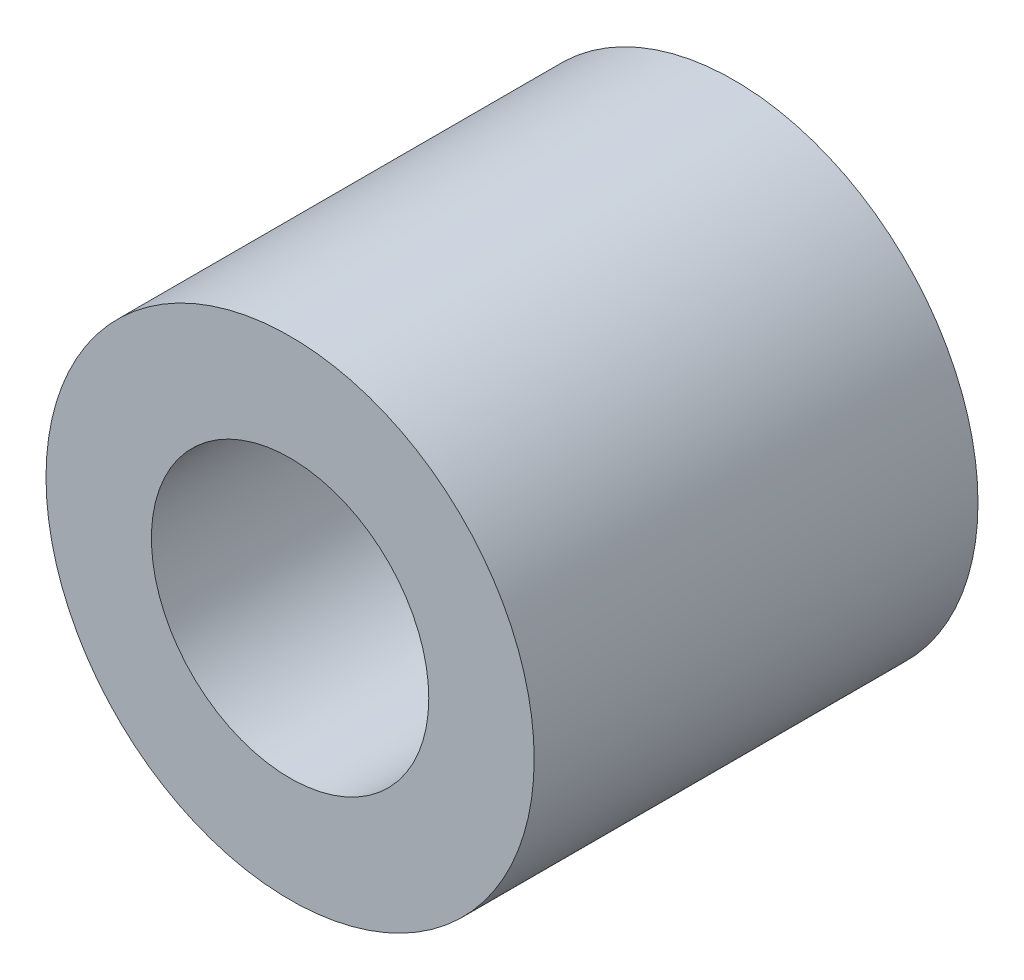
ISO-10303-21;
HEADER;
FILE_DESCRIPTION(('STEP AP214'),'2;1');
FILE_NAME('part.step','',(''),(''),'','','');
FILE_SCHEMA(('AUTOMOTIVE_DESIGN { 1 0 10303 214 1 1 1 1 }'));
ENDSEC;
DATA;
#1=APPLICATION_CONTEXT('core data for automotive mechanical design processes');
#2=APPLICATION_PROTOCOL_DEFINITION('international standard','automotive_design',2000,#1);
#3=PRODUCT_CONTEXT('',#1,'mechanical');
#4=PRODUCT('Part','Part','',(#3));
#5=PRODUCT_RELATED_PRODUCT_CATEGORY('part','',(#4));
#6=PRODUCT_DEFINITION_FORMATION('','',#4);
#7=PRODUCT_DEFINITION_CONTEXT('part definition',#1,'design');
#8=PRODUCT_DEFINITION('design','',#6,#7);
#9=PRODUCT_DEFINITION_SHAPE('','',#8);
#10=(LENGTH_UNIT() NAMED_UNIT(*) SI_UNIT(.MILLI.,.METRE.));
#11=(NAMED_UNIT(*) PLANE_ANGLE_UNIT() SI_UNIT($,.RADIAN.));
#12=(NAMED_UNIT(*) SI_UNIT($,.STERADIAN.) SOLID_ANGLE_UNIT());
#13=UNCERTAINTY_MEASURE_WITH_UNIT(LENGTH_MEASURE(1.E-05),#10,'distance_accuracy_value','');
#14=(GEOMETRIC_REPRESENTATION_CONTEXT(3) GLOBAL_UNCERTAINTY_ASSIGNED_CONTEXT((#13)) GLOBAL_UNIT_ASSIGNED_CONTEXT((#10,
#11,#12)) REPRESENTATION_CONTEXT('',''));
#15=CARTESIAN_POINT('',(0.,0.,0.));
#16=DIRECTION('',(0.,0.,1.));
#17=DIRECTION('',(1.,0.,0.));
#18=AXIS2_PLACEMENT_3D('',#15,#16,#17);
#19=CARTESIAN_POINT('',(0.,0.,4.));
#20=DIRECTION('',(0.,0.,1.));
#21=DIRECTION('',(1.,0.,0.));
#22=AXIS2_PLACEMENT_3D('',#19,#20,#21);
#23=PLANE('',#22);
#24=CARTESIAN_POINT('',(0.,0.,4.));
#25=DIRECTION('',(0.,0.,1.));
#26=DIRECTION('',(1.,0.,0.));
#27=AXIS2_PLACEMENT_3D('',#24,#25,#26);
#28=CIRCLE('',#27,2.2);
#29=CARTESIAN_POINT('',(2.2,0.,4.));
#30=VERTEX_POINT('',#29);
#31=EDGE_CURVE('E10',#30,#30,#28,.T.);
#32=ORIENTED_EDGE('',*,*,#31,.T.);
#33=EDGE_LOOP('',(#32));
#34=FACE_BOUND('',#33,.T.);
#35=CARTESIAN_POINT('',(0.,0.,4.));
#36=DIRECTION('',(0.,0.,1.));
#37=DIRECTION('',(1.,0.,0.));
#38=AXIS2_PLACEMENT_3D('',#35,#36,#37);
#39=CIRCLE('',#38,1.25);
#40=CARTESIAN_POINT('',(1.25,0.,4.));
#41=VERTEX_POINT('',#40);
#42=EDGE_CURVE('E46',#41,#41,#39,.T.);
#43=ORIENTED_EDGE('',*,*,#42,.F.);
#44=EDGE_LOOP('',(#43));
#45=FACE_BOUND('',#44,.T.);
#46=ADVANCED_FACE('F35',(#34,#45),#23,.T.);
#47=CARTESIAN_POINT('',(0.,0.,0.));
#48=DIRECTION('',(0.,0.,1.));
#49=DIRECTION('',(1.,0.,0.));
#50=AXIS2_PLACEMENT_3D('',#47,#48,#49);
#51=PLANE('',#50);
#52=CARTESIAN_POINT('',(0.,0.,0.));
#53=DIRECTION('',(0.,0.,1.));
#54=DIRECTION('',(1.,0.,0.));
#55=AXIS2_PLACEMENT_3D('',#52,#53,#54);
#56=CIRCLE('',#55,2.2);
#57=CARTESIAN_POINT('',(2.2,0.,0.));
#58=VERTEX_POINT('',#57);
#59=EDGE_CURVE('E39',#58,#58,#56,.T.);
#60=ORIENTED_EDGE('',*,*,#59,.F.);
#61=EDGE_LOOP('',(#60));
#62=FACE_BOUND('',#61,.T.);
#63=CARTESIAN_POINT('',(0.,0.,0.));
#64=DIRECTION('',(0.,0.,1.));
#65=DIRECTION('',(1.,0.,0.));
#66=AXIS2_PLACEMENT_3D('',#63,#64,#65);
#67=CIRCLE('',#66,1.25);
#68=CARTESIAN_POINT('',(1.25,0.,0.));
#69=VERTEX_POINT('',#68);
#70=EDGE_CURVE('E48',#69,#69,#67,.T.);
#71=ORIENTED_EDGE('',*,*,#70,.T.);
#72=EDGE_LOOP('',(#71));
#73=FACE_BOUND('',#72,.T.);
#74=ADVANCED_FACE('F58',(#62,#73),#51,.F.);
#75=CARTESIAN_POINT('',(0.,0.,4.));
#76=DIRECTION('',(0.,0.,-1.));
#77=DIRECTION('',(-1.,0.,0.));
#78=AXIS2_PLACEMENT_3D('',#75,#76,#77);
#79=CYLINDRICAL_SURFACE('',#78,2.2);
#80=ORIENTED_EDGE('',*,*,#31,.F.);
#81=EDGE_LOOP('',(#80));
#82=FACE_BOUND('',#81,.T.);
#83=ORIENTED_EDGE('',*,*,#59,.T.);
#84=EDGE_LOOP('',(#83));
#85=FACE_BOUND('',#84,.T.);
#86=ADVANCED_FACE('F37',(#82,#85),#79,.T.);
#87=CARTESIAN_POINT('',(0.,0.,4.));
#88=DIRECTION('',(0.,0.,-1.));
#89=DIRECTION('',(-1.,0.,0.));
#90=AXIS2_PLACEMENT_3D('',#87,#88,#89);
#91=CYLINDRICAL_SURFACE('',#90,1.25);
#92=ORIENTED_EDGE('',*,*,#42,.T.);
#93=EDGE_LOOP('',(#92));
#94=FACE_BOUND('',#93,.T.);
#95=ORIENTED_EDGE('',*,*,#70,.F.);
#96=EDGE_LOOP('',(#95));
#97=FACE_BOUND('',#96,.T.);
#98=ADVANCED_FACE('F54',(#94,#97),#91,.F.);
#99=CLOSED_SHELL('',(#46,#74,#86,#98));
#100=MANIFOLD_SOLID_BREP('B2',#99);
#101=ADVANCED_BREP_SHAPE_REPRESENTATION('',(#18,#100),#14);
#102=SHAPE_DEFINITION_REPRESENTATION(#9,#101);
ENDSEC;
END-ISO-10303-21;
